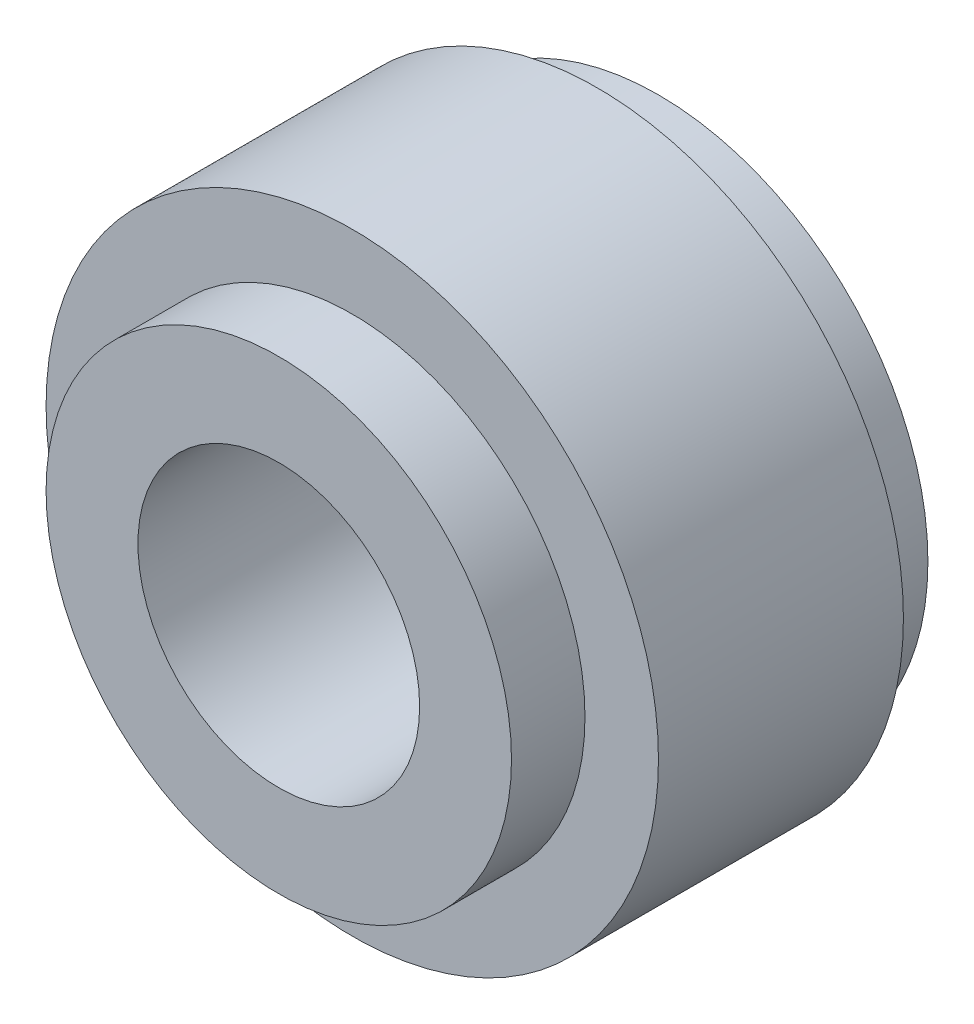
ISO-10303-21;
HEADER;
FILE_DESCRIPTION(('STEP AP214'),'2;1');
FILE_NAME('part.step','',(''),(''),'','','');
FILE_SCHEMA(('AUTOMOTIVE_DESIGN { 1 0 10303 214 1 1 1 1 }'));
ENDSEC;
DATA;
#1=APPLICATION_CONTEXT('core data for automotive mechanical design processes');
#2=APPLICATION_PROTOCOL_DEFINITION('international standard','automotive_design',2000,#1);
#3=PRODUCT_CONTEXT('',#1,'mechanical');
#4=PRODUCT('Part','Part','',(#3));
#5=PRODUCT_RELATED_PRODUCT_CATEGORY('part','',(#4));
#6=PRODUCT_DEFINITION_FORMATION('','',#4);
#7=PRODUCT_DEFINITION_CONTEXT('part definition',#1,'design');
#8=PRODUCT_DEFINITION('design','',#6,#7);
#9=PRODUCT_DEFINITION_SHAPE('','',#8);
#10=(LENGTH_UNIT() NAMED_UNIT(*) SI_UNIT(.MILLI.,.METRE.));
#11=(NAMED_UNIT(*) PLANE_ANGLE_UNIT() SI_UNIT($,.RADIAN.));
#12=(NAMED_UNIT(*) SI_UNIT($,.STERADIAN.) SOLID_ANGLE_UNIT());
#13=UNCERTAINTY_MEASURE_WITH_UNIT(LENGTH_MEASURE(1.E-05),#10,'distance_accuracy_value','');
#14=(GEOMETRIC_REPRESENTATION_CONTEXT(3) GLOBAL_UNCERTAINTY_ASSIGNED_CONTEXT((#13)) GLOBAL_UNIT_ASSIGNED_CONTEXT((#10,
#11,#12)) REPRESENTATION_CONTEXT('',''));
#15=CARTESIAN_POINT('',(0.,0.,0.));
#16=DIRECTION('',(0.,0.,1.));
#17=DIRECTION('',(1.,0.,0.));
#18=AXIS2_PLACEMENT_3D('',#15,#16,#17);
#19=CARTESIAN_POINT('',(0.,0.,20.));
#20=DIRECTION('',(0.,0.,-1.));
#21=DIRECTION('',(-1.,0.,0.));
#22=AXIS2_PLACEMENT_3D('',#19,#20,#21);
#23=CYLINDRICAL_SURFACE('',#22,25.);
#24=CARTESIAN_POINT('',(0.,0.,20.));
#25=DIRECTION('',(0.,0.,1.));
#26=DIRECTION('',(1.,0.,0.));
#27=AXIS2_PLACEMENT_3D('',#24,#25,#26);
#28=CIRCLE('',#27,25.);
#29=CARTESIAN_POINT('',(25.,0.,20.));
#30=VERTEX_POINT('',#29);
#31=EDGE_CURVE('E48',#30,#30,#28,.T.);
#32=ORIENTED_EDGE('',*,*,#31,.F.);
#33=EDGE_LOOP('',(#32));
#34=FACE_BOUND('',#33,.T.);
#35=CARTESIAN_POINT('',(0.,0.,0.));
#36=DIRECTION('',(0.,0.,1.));
#37=DIRECTION('',(1.,0.,0.));
#38=AXIS2_PLACEMENT_3D('',#35,#36,#37);
#39=CIRCLE('',#38,25.);
#40=CARTESIAN_POINT('',(25.,0.,0.));
#41=VERTEX_POINT('',#40);
#42=EDGE_CURVE('E39',#41,#41,#39,.T.);
#43=ORIENTED_EDGE('',*,*,#42,.T.);
#44=EDGE_LOOP('',(#43));
#45=FACE_BOUND('',#44,.T.);
#46=ADVANCED_FACE('F36',(#34,#45),#23,.T.);
#47=CARTESIAN_POINT('',(0.,0.,20.));
#48=DIRECTION('',(0.,0.,1.));
#49=DIRECTION('',(1.,0.,0.));
#50=AXIS2_PLACEMENT_3D('',#47,#48,#49);
#51=PLANE('',#50);
#52=CARTESIAN_POINT('',(0.,0.,20.));
#53=DIRECTION('',(0.,0.,1.));
#54=DIRECTION('',(1.,0.,0.));
#55=AXIS2_PLACEMENT_3D('',#52,#53,#54);
#56=CIRCLE('',#55,19.);
#57=CARTESIAN_POINT('',(19.,0.,20.));
#58=VERTEX_POINT('',#57);
#59=EDGE_CURVE('E43',#58,#58,#56,.T.);
#60=ORIENTED_EDGE('',*,*,#59,.F.);
#61=EDGE_LOOP('',(#60));
#62=FACE_BOUND('',#61,.T.);
#63=ORIENTED_EDGE('',*,*,#31,.T.);
#64=EDGE_LOOP('',(#63));
#65=FACE_BOUND('',#64,.T.);
#66=ADVANCED_FACE('F69',(#62,#65),#51,.T.);
#67=CARTESIAN_POINT('',(0.,0.,0.));
#68=DIRECTION('',(0.,0.,1.));
#69=DIRECTION('',(1.,0.,0.));
#70=AXIS2_PLACEMENT_3D('',#67,#68,#69);
#71=PLANE('',#70);
#72=CARTESIAN_POINT('',(0.,0.,0.));
#73=DIRECTION('',(0.,0.,-1.));
#74=DIRECTION('',(-1.,0.,0.));
#75=AXIS2_PLACEMENT_3D('',#72,#73,#74);
#76=CIRCLE('',#75,22.);
#77=CARTESIAN_POINT('',(-22.,0.,0.));
#78=VERTEX_POINT('',#77);
#79=EDGE_CURVE('E10',#78,#78,#76,.T.);
#80=ORIENTED_EDGE('',*,*,#79,.F.);
#81=EDGE_LOOP('',(#80));
#82=FACE_BOUND('',#81,.T.);
#83=ORIENTED_EDGE('',*,*,#42,.F.);
#84=EDGE_LOOP('',(#83));
#85=FACE_BOUND('',#84,.T.);
#86=ADVANCED_FACE('F66',(#82,#85),#71,.F.);
#87=CARTESIAN_POINT('',(0.,0.,26.));
#88=DIRECTION('',(0.,0.,-1.));
#89=DIRECTION('',(-1.,0.,0.));
#90=AXIS2_PLACEMENT_3D('',#87,#88,#89);
#91=CYLINDRICAL_SURFACE('',#90,19.);
#92=CARTESIAN_POINT('',(0.,0.,26.));
#93=DIRECTION('',(0.,0.,1.));
#94=DIRECTION('',(1.,0.,0.));
#95=AXIS2_PLACEMENT_3D('',#92,#93,#94);
#96=CIRCLE('',#95,19.);
#97=CARTESIAN_POINT('',(19.,0.,26.));
#98=VERTEX_POINT('',#97);
#99=EDGE_CURVE('E57',#98,#98,#96,.T.);
#100=ORIENTED_EDGE('',*,*,#99,.F.);
#101=EDGE_LOOP('',(#100));
#102=FACE_BOUND('',#101,.T.);
#103=ORIENTED_EDGE('',*,*,#59,.T.);
#104=EDGE_LOOP('',(#103));
#105=FACE_BOUND('',#104,.T.);
#106=ADVANCED_FACE('F68',(#102,#105),#91,.T.);
#107=CARTESIAN_POINT('',(0.,0.,26.));
#108=DIRECTION('',(0.,0.,1.));
#109=DIRECTION('',(1.,0.,0.));
#110=AXIS2_PLACEMENT_3D('',#107,#108,#109);
#111=PLANE('',#110);
#112=CARTESIAN_POINT('',(0.,0.,26.));
#113=DIRECTION('',(0.,0.,1.));
#114=DIRECTION('',(1.,0.,0.));
#115=AXIS2_PLACEMENT_3D('',#112,#113,#114);
#116=CIRCLE('',#115,11.5);
#117=CARTESIAN_POINT('',(11.5,0.,26.));
#118=VERTEX_POINT('',#117);
#119=EDGE_CURVE('E54',#118,#118,#116,.T.);
#120=ORIENTED_EDGE('',*,*,#119,.F.);
#121=EDGE_LOOP('',(#120));
#122=FACE_BOUND('',#121,.T.);
#123=ORIENTED_EDGE('',*,*,#99,.T.);
#124=EDGE_LOOP('',(#123));
#125=FACE_BOUND('',#124,.T.);
#126=ADVANCED_FACE('F75',(#122,#125),#111,.T.);
#127=CARTESIAN_POINT('',(0.,0.,-34.));
#128=DIRECTION('',(0.,0.,1.));
#129=DIRECTION('',(1.,0.,0.));
#130=AXIS2_PLACEMENT_3D('',#127,#128,#129);
#131=CYLINDRICAL_SURFACE('',#130,11.5);
#132=CARTESIAN_POINT('',(0.,0.,-5.));
#133=DIRECTION('',(0.,0.,-1.));
#134=DIRECTION('',(-1.,0.,0.));
#135=AXIS2_PLACEMENT_3D('',#132,#133,#134);
#136=CIRCLE('',#135,11.5);
#137=CARTESIAN_POINT('',(11.5,0.,-5.));
#138=VERTEX_POINT('',#137);
#139=EDGE_CURVE('E144',#138,#138,#136,.T.);
#140=CARTESIAN_POINT('',(11.5,0.,26.));
#141=CARTESIAN_POINT('',(11.5,0.,25.6770833333333));
#142=CARTESIAN_POINT('',(11.5,0.,25.3541666666667));
#143=CARTESIAN_POINT('',(11.5,0.,24.7083333333333));
#144=CARTESIAN_POINT('',(11.5,0.,24.3854166666667));
#145=CARTESIAN_POINT('',(11.5,0.,23.7395833333333));
#146=CARTESIAN_POINT('',(11.5,0.,23.4166666666667));
#147=CARTESIAN_POINT('',(11.5,0.,22.7708333333333));
#148=CARTESIAN_POINT('',(11.5,0.,22.4479166666667));
#149=CARTESIAN_POINT('',(11.5,0.,21.8020833333333));
#150=CARTESIAN_POINT('',(11.5,0.,21.4791666666667));
#151=CARTESIAN_POINT('',(11.5,0.,20.8333333333333));
#152=CARTESIAN_POINT('',(11.5,0.,20.5104166666667));
#153=CARTESIAN_POINT('',(11.5,0.,19.8645833333333));
#154=CARTESIAN_POINT('',(11.5,0.,19.5416666666667));
#155=CARTESIAN_POINT('',(11.5,0.,18.8958333333333));
#156=CARTESIAN_POINT('',(11.5,0.,18.5729166666667));
#157=CARTESIAN_POINT('',(11.5,0.,17.9270833333333));
#158=CARTESIAN_POINT('',(11.5,0.,17.6041666666667));
#159=CARTESIAN_POINT('',(11.5,0.,16.9583333333333));
#160=CARTESIAN_POINT('',(11.5,0.,16.6354166666667));
#161=CARTESIAN_POINT('',(11.5,0.,15.9895833333333));
#162=CARTESIAN_POINT('',(11.5,0.,15.6666666666667));
#163=CARTESIAN_POINT('',(11.5,0.,15.0208333333333));
#164=CARTESIAN_POINT('',(11.5,0.,14.6979166666667));
#165=CARTESIAN_POINT('',(11.5,0.,14.0520833333333));
#166=CARTESIAN_POINT('',(11.5,0.,13.7291666666667));
#167=CARTESIAN_POINT('',(11.5,0.,13.0833333333333));
#168=CARTESIAN_POINT('',(11.5,0.,12.7604166666667));
#169=CARTESIAN_POINT('',(11.5,0.,12.1145833333333));
#170=CARTESIAN_POINT('',(11.5,0.,11.7916666666667));
#171=CARTESIAN_POINT('',(11.5,0.,11.1458333333333));
#172=CARTESIAN_POINT('',(11.5,0.,10.8229166666667));
#173=CARTESIAN_POINT('',(11.5,0.,10.1770833333333));
#174=CARTESIAN_POINT('',(11.5,0.,9.85416666666667));
#175=CARTESIAN_POINT('',(11.5,0.,9.20833333333333));
#176=CARTESIAN_POINT('',(11.5,0.,8.88541666666666));
#177=CARTESIAN_POINT('',(11.5,0.,8.23958333333333));
#178=CARTESIAN_POINT('',(11.5,0.,7.91666666666667));
#179=CARTESIAN_POINT('',(11.5,0.,7.27083333333333));
#180=CARTESIAN_POINT('',(11.5,0.,6.94791666666667));
#181=CARTESIAN_POINT('',(11.5,0.,6.30208333333333));
#182=CARTESIAN_POINT('',(11.5,0.,5.97916666666666));
#183=CARTESIAN_POINT('',(11.5,0.,5.33333333333333));
#184=CARTESIAN_POINT('',(11.5,0.,5.01041666666666));
#185=CARTESIAN_POINT('',(11.5,0.,4.36458333333333));
#186=CARTESIAN_POINT('',(11.5,0.,4.04166666666667));
#187=CARTESIAN_POINT('',(11.5,0.,3.39583333333333));
#188=CARTESIAN_POINT('',(11.5,0.,3.07291666666666));
#189=CARTESIAN_POINT('',(11.5,0.,2.42708333333333));
#190=CARTESIAN_POINT('',(11.5,0.,2.10416666666666));
#191=CARTESIAN_POINT('',(11.5,0.,1.45833333333333));
#192=CARTESIAN_POINT('',(11.5,0.,1.13541666666667));
#193=CARTESIAN_POINT('',(11.5,0.,0.489583333333333));
#194=CARTESIAN_POINT('',(11.5,0.,0.166666666666664));
#195=CARTESIAN_POINT('',(11.5,0.,-0.479166666666672));
#196=CARTESIAN_POINT('',(11.5,0.,-0.80208333333334));
#197=CARTESIAN_POINT('',(11.5,0.,-1.44791666666667));
#198=CARTESIAN_POINT('',(11.5,0.,-1.77083333333334));
#199=CARTESIAN_POINT('',(11.5,0.,-2.41666666666667));
#200=CARTESIAN_POINT('',(11.5,0.,-2.73958333333333));
#201=CARTESIAN_POINT('',(11.5,0.,-3.38541666666667));
#202=CARTESIAN_POINT('',(11.5,0.,-3.70833333333333));
#203=CARTESIAN_POINT('',(11.5,0.,-4.35416666666667));
#204=CARTESIAN_POINT('',(11.5,0.,-4.67708333333333));
#205=CARTESIAN_POINT('',(11.5,0.,-5.));
#206=B_SPLINE_CURVE_WITH_KNOTS('',3,(#140,#141,#142,#143,#144,#145,#146,#147,#148,#149,#150,
#151,#152,#153,#154,#155,#156,#157,#158,#159,#160,#161,#162,#163,#164,#165,#166,#167,#168,#169,
#170,#171,#172,#173,#174,#175,#176,#177,#178,#179,#180,#181,#182,#183,#184,#185,#186,#187,#188,
#189,#190,#191,#192,#193,#194,#195,#196,#197,#198,#199,#200,#201,#202,#203,#204,#205),
.UNSPECIFIED.,.F.,.F.,(4,2,2,2,2,2,2,2,2,2,2,2,2,2,2,2,2,2,2,2,2,2,2,2,2,2,2,2,2,2,2,2,4),(0.,
0.968749999999997,1.9375,2.90625,3.875,4.84375,5.8125,6.78125,7.75,8.71875,9.6875,10.65625,
11.625,12.59375,13.5625,14.53125,15.5,16.46875,17.4375,18.40625,19.375,20.34375,21.3125,
22.28125,23.25,24.21875,25.1875,26.15625,27.125,28.09375,29.0625,30.03125,31.),.UNSPECIFIED.);
#207=EDGE_CURVE('BSEAM103',#118,#138,#206,.T.);
#208=ORIENTED_EDGE('',*,*,#119,.T.);
#209=ORIENTED_EDGE('',*,*,#139,.T.);
#210=ORIENTED_EDGE('',*,*,#207,.T.);
#211=ORIENTED_EDGE('',*,*,#207,.F.);
#212=EDGE_LOOP('',(#208,#210,#209,#211));
#213=FACE_BOUND('',#212,.T.);
#214=ADVANCED_FACE('F103',(#213),#131,.F.);
#215=CARTESIAN_POINT('',(0.,0.,-5.));
#216=DIRECTION('',(0.,0.,-1.));
#217=DIRECTION('',(-1.,0.,0.));
#218=AXIS2_PLACEMENT_3D('',#215,#216,#217);
#219=PLANE('',#218);
#220=CARTESIAN_POINT('',(0.,0.,-5.));
#221=DIRECTION('',(0.,0.,-1.));
#222=DIRECTION('',(-1.,0.,0.));
#223=AXIS2_PLACEMENT_3D('',#220,#221,#222);
#224=CIRCLE('',#223,22.);
#225=CARTESIAN_POINT('',(-22.,0.,-5.));
#226=VERTEX_POINT('',#225);
#227=EDGE_CURVE('E52',#226,#226,#224,.T.);
#228=ORIENTED_EDGE('',*,*,#227,.T.);
#229=EDGE_LOOP('',(#228));
#230=FACE_BOUND('',#229,.T.);
#231=ORIENTED_EDGE('',*,*,#139,.F.);
#232=EDGE_LOOP('',(#231));
#233=FACE_BOUND('',#232,.T.);
#234=ADVANCED_FACE('F118',(#230,#233),#219,.T.);
#235=CARTESIAN_POINT('',(0.,0.,-5.));
#236=DIRECTION('',(0.,0.,1.));
#237=DIRECTION('',(1.,0.,0.));
#238=AXIS2_PLACEMENT_3D('',#235,#236,#237);
#239=CYLINDRICAL_SURFACE('',#238,22.);
#240=ORIENTED_EDGE('',*,*,#227,.F.);
#241=EDGE_LOOP('',(#240));
#242=FACE_BOUND('',#241,.T.);
#243=ORIENTED_EDGE('',*,*,#79,.T.);
#244=EDGE_LOOP('',(#243));
#245=FACE_BOUND('',#244,.T.);
#246=ADVANCED_FACE('F128',(#242,#245),#239,.T.);
#247=CLOSED_SHELL('',(#46,#66,#86,#106,#126,#214,#234,#246));
#248=MANIFOLD_SOLID_BREP('B2',#247);
#249=ADVANCED_BREP_SHAPE_REPRESENTATION('',(#18,#248),#14);
#250=SHAPE_DEFINITION_REPRESENTATION(#9,#249);
ENDSEC;
END-ISO-10303-21;
